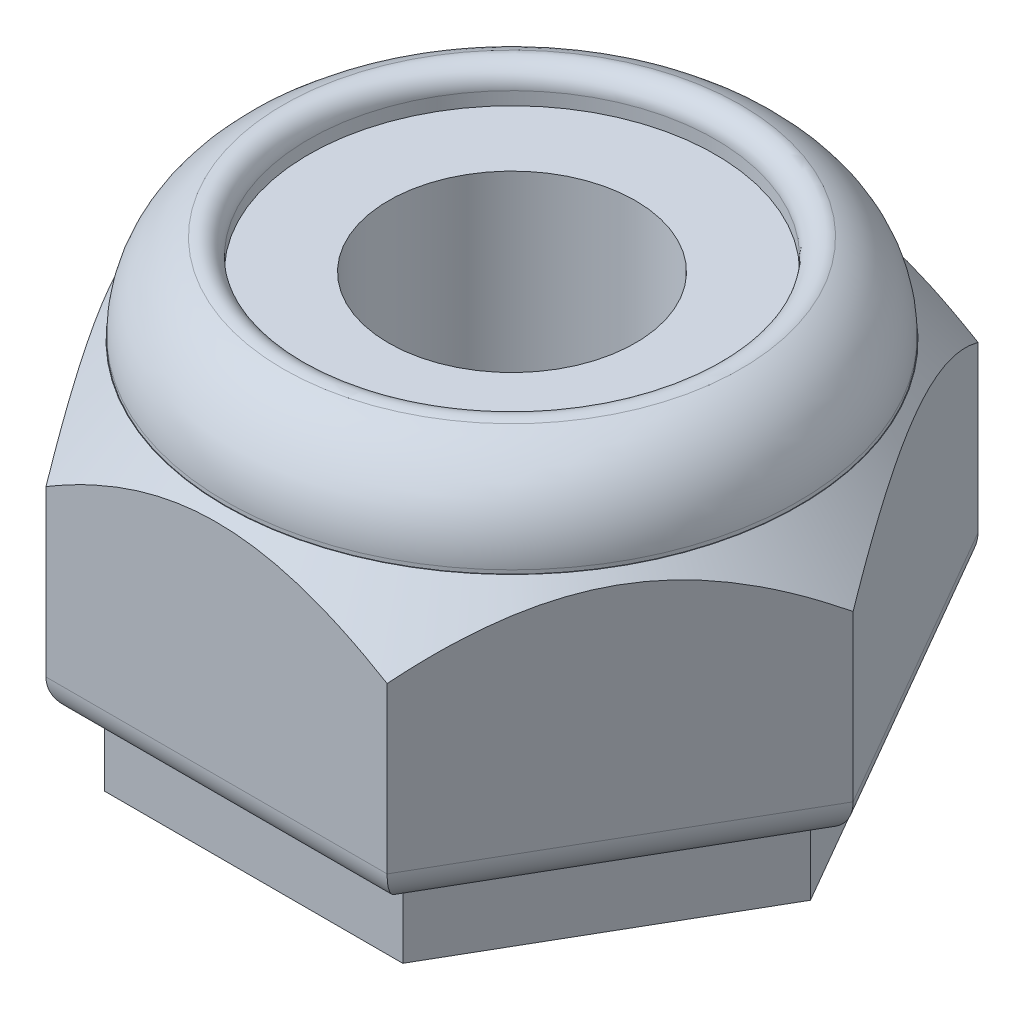
ISO-10303-21;
HEADER;
FILE_DESCRIPTION(('STEP AP214'),'2;1');
FILE_NAME('part.step','',(''),(''),'','','');
FILE_SCHEMA(('AUTOMOTIVE_DESIGN { 1 0 10303 214 1 1 1 1 }'));
ENDSEC;
DATA;
#1=APPLICATION_CONTEXT('core data for automotive mechanical design processes');
#2=APPLICATION_PROTOCOL_DEFINITION('international standard','automotive_design',2000,#1);
#3=PRODUCT_CONTEXT('',#1,'mechanical');
#4=PRODUCT('Part','Part','',(#3));
#5=PRODUCT_RELATED_PRODUCT_CATEGORY('part','',(#4));
#6=PRODUCT_DEFINITION_FORMATION('','',#4);
#7=PRODUCT_DEFINITION_CONTEXT('part definition',#1,'design');
#8=PRODUCT_DEFINITION('design','',#6,#7);
#9=PRODUCT_DEFINITION_SHAPE('','',#8);
#10=(LENGTH_UNIT() NAMED_UNIT(*) SI_UNIT(.MILLI.,.METRE.));
#11=(NAMED_UNIT(*) PLANE_ANGLE_UNIT() SI_UNIT($,.RADIAN.));
#12=(NAMED_UNIT(*) SI_UNIT($,.STERADIAN.) SOLID_ANGLE_UNIT());
#13=UNCERTAINTY_MEASURE_WITH_UNIT(LENGTH_MEASURE(1.E-05),#10,'distance_accuracy_value','');
#14=(GEOMETRIC_REPRESENTATION_CONTEXT(3) GLOBAL_UNCERTAINTY_ASSIGNED_CONTEXT((#13)) GLOBAL_UNIT_ASSIGNED_CONTEXT((#10,
#11,#12)) REPRESENTATION_CONTEXT('',''));
#15=CARTESIAN_POINT('',(0.,0.,0.));
#16=DIRECTION('',(0.,0.,1.));
#17=DIRECTION('',(1.,0.,0.));
#18=AXIS2_PLACEMENT_3D('',#15,#16,#17);
#19=CARTESIAN_POINT('',(0.,4.9784,0.));
#20=DIRECTION('',(0.,-1.,0.));
#21=DIRECTION('',(0.,0.,-1.));
#22=AXIS2_PLACEMENT_3D('',#19,#20,#21);
#23=CYLINDRICAL_SURFACE('',#22,3.937);
#24=CARTESIAN_POINT('',(0.,3.7084,0.));
#25=DIRECTION('',(0.,1.,0.));
#26=DIRECTION('',(-1.,0.,0.));
#27=AXIS2_PLACEMENT_3D('',#24,#25,#26);
#28=CIRCLE('',#27,3.937);
#29=CARTESIAN_POINT('',(-3.937,3.7084,0.));
#30=VERTEX_POINT('',#29);
#31=EDGE_CURVE('E143',#30,#30,#28,.T.);
#32=ORIENTED_EDGE('',*,*,#31,.F.);
#33=EDGE_LOOP('',(#32));
#34=FACE_BOUND('',#33,.T.);
#35=CARTESIAN_POINT('',(0.,3.6576,0.));
#36=DIRECTION('',(0.,-1.,0.));
#37=DIRECTION('',(0.,0.,-1.));
#38=AXIS2_PLACEMENT_3D('',#35,#36,#37);
#39=CIRCLE('',#38,3.937);
#40=CARTESIAN_POINT('',(0.,3.6576,-3.937));
#41=VERTEX_POINT('',#40);
#42=EDGE_CURVE('E21',#41,#41,#39,.F.);
#43=ORIENTED_EDGE('',*,*,#42,.T.);
#44=EDGE_LOOP('',(#43));
#45=FACE_BOUND('',#44,.T.);
#46=ADVANCED_FACE('F17',(#34,#45),#23,.T.);
#47=CARTESIAN_POINT('',(0.,3.7084,0.));
#48=DIRECTION('',(0.,-1.,0.));
#49=DIRECTION('',(1.,0.,0.));
#50=AXIS2_PLACEMENT_3D('',#47,#48,#49);
#51=TOROIDAL_SURFACE('',#50,2.667,1.27);
#52=ORIENTED_EDGE('',*,*,#31,.T.);
#53=EDGE_LOOP('',(#52));
#54=FACE_BOUND('',#53,.T.);
#55=CARTESIAN_POINT('',(0.,4.88572150982674,0.));
#56=DIRECTION('',(0.,1.,0.));
#57=DIRECTION('',(0.,0.,1.));
#58=AXIS2_PLACEMENT_3D('',#55,#56,#57);
#59=CIRCLE('',#58,3.14325000000061);
#60=CARTESIAN_POINT('',(0.,4.88572150982674,3.14325000000061));
#61=VERTEX_POINT('',#60);
#62=EDGE_CURVE('E140',#61,#61,#59,.T.);
#63=ORIENTED_EDGE('',*,*,#62,.F.);
#64=EDGE_LOOP('',(#63));
#65=FACE_BOUND('',#64,.T.);
#66=ADVANCED_FACE('F326',(#54,#65),#51,.T.);
#67=CARTESIAN_POINT('',(2.34315,3.6576,4.05845484975428));
#68=DIRECTION('',(0.,-1.,0.));
#69=DIRECTION('',(0.,0.,-1.));
#70=AXIS2_PLACEMENT_3D('',#67,#68,#69);
#71=PLANE('',#70);
#72=CARTESIAN_POINT('',(0.,3.65760000005366,0.));
#73=DIRECTION('',(0.,-1.,0.));
#74=DIRECTION('',(0.,0.,-1.));
#75=AXIS2_PLACEMENT_3D('',#72,#73,#74);
#76=CIRCLE('',#75,3.94407100941407);
#77=CARTESIAN_POINT('',(0.,3.65760000005366,-3.94407100941407));
#78=VERTEX_POINT('',#77);
#79=EDGE_CURVE('E139',#78,#78,#76,.T.);
#80=ORIENTED_EDGE('',*,*,#79,.F.);
#81=EDGE_LOOP('',(#80));
#82=FACE_BOUND('',#81,.T.);
#83=ORIENTED_EDGE('',*,*,#42,.F.);
#84=EDGE_LOOP('',(#83));
#85=FACE_BOUND('',#84,.T.);
#86=ADVANCED_FACE('F201',(#82,#85),#71,.F.);
#87=CARTESIAN_POINT('',(0.,4.6502572078617,0.));
#88=DIRECTION('',(0.,-1.,0.));
#89=DIRECTION('',(0.,0.,-1.));
#90=AXIS2_PLACEMENT_3D('',#87,#88,#89);
#91=TOROIDAL_SURFACE('',#90,3.048,0.254);
#92=CARTESIAN_POINT('',(0.,4.6502572078617,0.));
#93=DIRECTION('',(0.,1.,0.));
#94=DIRECTION('',(0.,0.,1.));
#95=AXIS2_PLACEMENT_3D('',#92,#93,#94);
#96=CIRCLE('',#95,2.794);
#97=CARTESIAN_POINT('',(0.,4.6502572078617,2.794));
#98=VERTEX_POINT('',#97);
#99=EDGE_CURVE('E116',#98,#98,#96,.F.);
#100=ORIENTED_EDGE('',*,*,#99,.T.);
#101=EDGE_LOOP('',(#100));
#102=FACE_BOUND('',#101,.T.);
#103=ORIENTED_EDGE('',*,*,#62,.T.);
#104=EDGE_LOOP('',(#103));
#105=FACE_BOUND('',#104,.T.);
#106=ADVANCED_FACE('F19',(#102,#105),#91,.T.);
#107=CARTESIAN_POINT('',(0.,2.76773860963431,0.));
#108=DIRECTION('',(0.,-1.,0.));
#109=DIRECTION('',(0.,0.,-1.));
#110=AXIS2_PLACEMENT_3D('',#107,#108,#109);
#111=CONICAL_SURFACE('',#110,4.69075337394997,0.69813170082155);
#112=CARTESIAN_POINT('',(-2.34315000000503,2.77304593403586,4.05845484975428));
#113=CARTESIAN_POINT('',(-2.27415972165278,2.81414935275577,4.05845484975428));
#114=CARTESIAN_POINT('',(-2.20457738516752,2.85425669888616,4.05845484975428));
#115=CARTESIAN_POINT('',(-2.06410193522583,2.93218331971622,4.05845484975428));
#116=CARTESIAN_POINT('',(-1.99320821635581,2.97000150134695,4.05845484975428));
#117=CARTESIAN_POINT('',(-1.77754688766656,3.07999086389214,4.05845484975428));
#118=CARTESIAN_POINT('',(-1.63068545864015,3.14815894039376,4.05845484975428));
#119=CARTESIAN_POINT('',(-1.33052752451739,3.27077676920759,4.05845484975428));
#120=CARTESIAN_POINT('',(-1.17720631603001,3.32516696805276,4.05845484975428));
#121=CARTESIAN_POINT('',(-0.865613503742559,3.41574608766322,4.05845484975428));
#122=CARTESIAN_POINT('',(-0.707359229246045,3.45199244874761,4.05845484975428));
#123=CARTESIAN_POINT('',(-0.456822143289617,3.49192146545915,4.05845484975428));
#124=CARTESIAN_POINT('',(-0.3656729211117,3.50290887294284,4.05845484975428));
#125=CARTESIAN_POINT('',(-0.183016321982117,3.51758027912042,4.05845484975428));
#126=CARTESIAN_POINT('',(-0.0915105175139001,3.52128341035451,4.05845484975428));
#127=CARTESIAN_POINT('',(0.104649468640172,3.52128177490176,4.05845484975428));
#128=CARTESIAN_POINT('',(0.209305100869491,3.51643705331943,4.05845484975428));
#129=CARTESIAN_POINT('',(0.417787181905034,3.49730239558541,4.05845484975428));
#130=CARTESIAN_POINT('',(0.521613181347001,3.48300765110126,4.05845484975428));
#131=CARTESIAN_POINT('',(0.728332544905683,3.44553375884967,4.05845484975428));
#132=CARTESIAN_POINT('',(0.831215331549728,3.42229697723049,4.05845484975428));
#133=CARTESIAN_POINT('',(1.03487580390072,3.36791830053848,4.05845484975428));
#134=CARTESIAN_POINT('',(1.13565289467684,3.3367742032106,4.05845484975428));
#135=CARTESIAN_POINT('',(1.33273383820583,3.2683874191788,4.05845484975428));
#136=CARTESIAN_POINT('',(1.4290871622408,3.23128582684769,4.05845484975428));
#137=CARTESIAN_POINT('',(1.61947291705641,3.15151071592813,4.05845484975428));
#138=CARTESIAN_POINT('',(1.71350470706801,3.10883567900622,4.05845484975428));
#139=CARTESIAN_POINT('',(1.89803195378754,3.01941532333673,4.05845484975428));
#140=CARTESIAN_POINT('',(1.98855798042494,2.97273255728481,4.05845484975428));
#141=CARTESIAN_POINT('',(2.16742834953656,2.87556944087748,4.05845484975428));
#142=CARTESIAN_POINT('',(2.25577492887676,2.82509321935989,4.05845484975428));
#143=CARTESIAN_POINT('',(2.34315000000525,2.77304593403573,4.05845484975428));
#144=B_SPLINE_CURVE_WITH_KNOTS('',3,(#112,#113,#114,#115,#116,#117,#118,#119,#120,#121,#122,
#123,#124,#125,#126,#127,#128,#129,#130,#131,#132,#133,#134,#135,#136,#137,#138,#139,#140,#141,
#142,#143),.UNSPECIFIED.,.F.,.F.,(4,2,2,2,2,2,2,2,2,2,2,2,2,2,2,4),(0.,0.240903303558803,
0.481920744734919,0.967059466966206,1.45426068374679,1.9399095917674,2.21507934692009,
2.48952538382291,2.80337599588965,3.11738642352583,3.43345557964228,3.74961286046901,
4.05916118097216,4.3687940060889,4.6742570853317,4.97939238053971),.UNSPECIFIED.);
#145=CARTESIAN_POINT('',(-2.34315000000099,2.77304593403526,4.05845484975719));
#146=VERTEX_POINT('',#145);
#147=CARTESIAN_POINT('',(2.34315000000292,2.77304593403765,4.05845484975376));
#148=VERTEX_POINT('',#147);
#149=EDGE_CURVE('E105',#146,#148,#144,.T.);
#150=ORIENTED_EDGE('',*,*,#149,.T.);
#151=CARTESIAN_POINT('',(2.34314999999693,2.7730459340352,4.05845484975959));
#152=CARTESIAN_POINT('',(2.37767282860283,2.81418235893276,3.99865955659319));
#153=CARTESIAN_POINT('',(2.41249219713531,2.85432113114593,3.93835064120748));
#154=CARTESIAN_POINT('',(2.48278735561404,2.93230661024316,3.81659585519621));
#155=CARTESIAN_POINT('',(2.51826344808292,2.97015222465259,3.7551494605861));
#156=CARTESIAN_POINT('',(2.62615438117551,3.08018701502904,3.56827688279372));
#157=CARTESIAN_POINT('',(2.69961665998572,3.14837015578544,3.44103648345466));
#158=CARTESIAN_POINT('',(2.84967035005879,3.27092778611003,3.18113586838493));
#159=CARTESIAN_POINT('',(2.92627056070785,3.32525984887746,3.04846041167028));
#160=CARTESIAN_POINT('',(3.08197408351963,3.41577217646363,2.77877399924282));
#161=CARTESIAN_POINT('',(3.16107001759542,3.45200143013163,2.64177582275144));
#162=CARTESIAN_POINT('',(3.29198414807309,3.49372811242707,2.41502589733543));
#163=CARTESIAN_POINT('',(3.34330313984229,3.50560413714313,2.32613879619797));
#164=CARTESIAN_POINT('',(3.44628593295617,3.52008140701373,2.14776736621938));
#165=CARTESIAN_POINT('',(3.49794979170342,3.52268106751377,2.05828293795409));
#166=CARTESIAN_POINT('',(3.60089965453731,3.51847006522478,1.87996854489356));
#167=CARTESIAN_POINT('',(3.65218619119779,3.51171021115691,1.79113765765336));
#168=CARTESIAN_POINT('',(3.75425802296563,3.48921023552174,1.61434405900985));
#169=CARTESIAN_POINT('',(3.80504329290657,3.4734696653816,1.52638139119605));
#170=CARTESIAN_POINT('',(3.91981939871964,3.42817062217697,1.32758334443292));
#171=CARTESIAN_POINT('',(3.98355100429821,3.39598542071065,1.2171969655229));
#172=CARTESIAN_POINT('',(4.10926833268307,3.32004827839878,0.999448165368507));
#173=CARTESIAN_POINT('',(4.17125308046242,3.27629001407983,0.892087432920332));
#174=CARTESIAN_POINT('',(4.29356093179487,3.17910361378463,0.680244020247964));
#175=CARTESIAN_POINT('',(4.35387635271594,3.12563730722699,0.575774646732767));
#176=CARTESIAN_POINT('',(4.47261995690137,3.01104764598552,0.370104691209757));
#177=CARTESIAN_POINT('',(4.53104876921398,2.94992687737875,0.268903019658414));
#178=CARTESIAN_POINT('',(4.60505373916612,2.86741854615462,0.140722651688709));
#179=CARTESIAN_POINT('',(4.62142679900212,2.84883596641678,0.11236368017739));
#180=CARTESIAN_POINT('',(4.65398784239057,2.81125673905797,0.0559662986811411));
#181=CARTESIAN_POINT('',(4.67017623558143,2.79226151162781,0.0279271791816869));
#182=CARTESIAN_POINT('',(4.68630000000264,2.77304593403495,-5.12766597102743E-12));
#183=B_SPLINE_CURVE_WITH_KNOTS('',3,(#151,#152,#153,#154,#155,#156,#157,#158,#159,#160,#161,
#162,#163,#164,#165,#166,#167,#168,#169,#170,#171,#172,#173,#174,#175,#176,#177,#178,#179,#180,
#181,#182),.UNSPECIFIED.,.F.,.F.,(4,2,2,2,2,2,2,2,2,2,2,2,2,2,2,4),(0.,0.241096809088417,
0.482307589452315,0.967637153847078,1.45443592242607,1.93991010956602,2.24950193434581,
2.55914664327121,2.86711700075051,3.17510274221903,3.56882084719782,3.96275452415155,
4.35827201945911,4.75365624697757,4.8666083898492,4.97921936890997),.UNSPECIFIED.);
#184=CARTESIAN_POINT('',(4.68630000000163,2.77304593403615,-2.0235874094859E-12));
#185=VERTEX_POINT('',#184);
#186=EDGE_CURVE('E179',#148,#185,#183,.T.);
#187=ORIENTED_EDGE('',*,*,#186,.T.);
#188=CARTESIAN_POINT('',(4.68630000000062,2.77304593403735,1.0800383224823E-12));
#189=CARTESIAN_POINT('',(4.65177717139479,2.81418235893479,-0.0597952931652156));
#190=CARTESIAN_POINT('',(4.61695780286237,2.85432113114784,-0.120104208550831));
#191=CARTESIAN_POINT('',(4.54666264438375,2.93230661024482,-0.241858994561891));
#192=CARTESIAN_POINT('',(4.51118655191493,2.97015222465413,-0.303305389171897));
#193=CARTESIAN_POINT('',(4.40329561882253,3.08018701503022,-0.49017796696395));
#194=CARTESIAN_POINT('',(4.32983334001245,3.1483701557864,-0.617418366302786));
#195=CARTESIAN_POINT('',(4.17977964993967,3.27092778611056,-0.877318981372035));
#196=CARTESIAN_POINT('',(4.10317943929075,3.32525984887779,-1.00999443808643));
#197=CARTESIAN_POINT('',(3.94747591647927,3.41577217646364,-1.27968085051336));
#198=CARTESIAN_POINT('',(3.86837998240365,3.45200143013151,-1.41667902700445));
#199=CARTESIAN_POINT('',(3.73746585192614,3.49372811242684,-1.64342895242018));
#200=CARTESIAN_POINT('',(3.68614686015695,3.50560413714288,-1.73231605355763));
#201=CARTESIAN_POINT('',(3.58316406704307,3.52008140701343,-1.91068748353621));
#202=CARTESIAN_POINT('',(3.53150020829583,3.52268106751345,-2.00017191180149));
#203=CARTESIAN_POINT('',(3.42855034546195,3.51847006522442,-2.17848630486201));
#204=CARTESIAN_POINT('',(3.37726380880147,3.51171021115652,-2.2673171921022));
#205=CARTESIAN_POINT('',(3.27519197703364,3.48921023552132,-2.44411079074569));
#206=CARTESIAN_POINT('',(3.2244067070927,3.47346966538116,-2.53207345855949));
#207=CARTESIAN_POINT('',(3.10963060127963,3.42817062217649,-2.73087150532264));
#208=CARTESIAN_POINT('',(3.04589899570104,3.39598542071013,-2.84125788423269));
#209=CARTESIAN_POINT('',(2.92018166731615,3.32004827839821,-3.05900668438713));
#210=CARTESIAN_POINT('',(2.85819691953678,3.27629001407922,-3.16636741683533));
#211=CARTESIAN_POINT('',(2.73588906820431,3.17910361378396,-3.37821082950774));
#212=CARTESIAN_POINT('',(2.67557364728322,3.12563730722629,-3.48268020302296));
#213=CARTESIAN_POINT('',(2.55683004309777,3.01104764598475,-3.68835015854601));
#214=CARTESIAN_POINT('',(2.49840123078514,2.94992687737795,-3.78955183009737));
#215=CARTESIAN_POINT('',(2.42439626083308,2.86741854615387,-3.91773219806696));
#216=CARTESIAN_POINT('',(2.40802320099716,2.84883596641612,-3.94609116957814));
#217=CARTESIAN_POINT('',(2.37546215760886,2.81125673905749,-4.00248855107411));
#218=CARTESIAN_POINT('',(2.35927376441809,2.79226151162742,-4.03052767057343));
#219=CARTESIAN_POINT('',(2.34314999999696,2.77304593403466,-4.0584548497601));
#220=B_SPLINE_CURVE_WITH_KNOTS('',3,(#188,#189,#190,#191,#192,#193,#194,#195,#196,#197,#198,
#199,#200,#201,#202,#203,#204,#205,#206,#207,#208,#209,#210,#211,#212,#213,#214,#215,#216,#217,
#218,#219),.UNSPECIFIED.,.F.,.F.,(4,2,2,2,2,2,2,2,2,2,2,2,2,2,2,4),(0.,0.241096809087928,
0.482307589451335,0.967637153845095,1.45443592242307,1.939910109562,2.24950193434176,
2.55914664326713,2.86711700074641,3.17510274221491,3.56882084719382,3.96275452414766,
4.35827201945532,4.7536562469739,4.86660838984497,4.97921936890519),.UNSPECIFIED.);
#221=CARTESIAN_POINT('',(2.34315000000099,2.77304593403526,-4.05845484975719));
#222=VERTEX_POINT('',#221);
#223=EDGE_CURVE('E186',#185,#222,#220,.T.);
#224=ORIENTED_EDGE('',*,*,#223,.T.);
#225=CARTESIAN_POINT('',(2.34315000000503,2.77304593403586,-4.05845484975428));
#226=CARTESIAN_POINT('',(2.27415972165278,2.81414935275577,-4.05845484975428));
#227=CARTESIAN_POINT('',(2.20457738516752,2.85425669888616,-4.05845484975428));
#228=CARTESIAN_POINT('',(2.06410193522583,2.93218331971622,-4.05845484975428));
#229=CARTESIAN_POINT('',(1.99320821635581,2.97000150134695,-4.05845484975428));
#230=CARTESIAN_POINT('',(1.77754688766656,3.07999086389214,-4.05845484975428));
#231=CARTESIAN_POINT('',(1.63068545864015,3.14815894039376,-4.05845484975428));
#232=CARTESIAN_POINT('',(1.33052752451739,3.27077676920759,-4.05845484975428));
#233=CARTESIAN_POINT('',(1.17720631603001,3.32516696805276,-4.05845484975428));
#234=CARTESIAN_POINT('',(0.865613503742559,3.41574608766322,-4.05845484975428));
#235=CARTESIAN_POINT('',(0.707359229246045,3.45199244874761,-4.05845484975428));
#236=CARTESIAN_POINT('',(0.456822143289617,3.49192146545915,-4.05845484975428));
#237=CARTESIAN_POINT('',(0.3656729211117,3.50290887294284,-4.05845484975428));
#238=CARTESIAN_POINT('',(0.183016321982117,3.51758027912042,-4.05845484975428));
#239=CARTESIAN_POINT('',(0.0915105175139003,3.52128341035451,-4.05845484975428));
#240=CARTESIAN_POINT('',(-0.104649468640172,3.52128177490176,-4.05845484975428));
#241=CARTESIAN_POINT('',(-0.20930510086949,3.51643705331943,-4.05845484975428));
#242=CARTESIAN_POINT('',(-0.417787181905032,3.49730239558541,-4.05845484975428));
#243=CARTESIAN_POINT('',(-0.521613181346999,3.48300765110126,-4.05845484975428));
#244=CARTESIAN_POINT('',(-0.728332544905681,3.44553375884966,-4.05845484975428));
#245=CARTESIAN_POINT('',(-0.831215331549726,3.42229697723049,-4.05845484975428));
#246=CARTESIAN_POINT('',(-1.03487580390072,3.36791830053848,-4.05845484975428));
#247=CARTESIAN_POINT('',(-1.13565289467684,3.3367742032106,-4.05845484975428));
#248=CARTESIAN_POINT('',(-1.33273383820593,3.26838741917876,-4.05845484975428));
#249=CARTESIAN_POINT('',(-1.42908716224099,3.23128582684762,-4.05845484975428));
#250=CARTESIAN_POINT('',(-1.61947291705679,3.15151071592796,-4.05845484975428));
#251=CARTESIAN_POINT('',(-1.71350470706848,3.108835679006,-4.05845484975428));
#252=CARTESIAN_POINT('',(-1.89803195378819,3.01941532333641,-4.05845484975428));
#253=CARTESIAN_POINT('',(-1.98855798042567,2.97273255728443,-4.05845484975428));
#254=CARTESIAN_POINT('',(-2.16742834953745,2.87556944087698,-4.05845484975428));
#255=CARTESIAN_POINT('',(-2.25577492887773,2.82509321935933,-4.05845484975428));
#256=CARTESIAN_POINT('',(-2.3431500000063,2.7730459340351,-4.05845484975428));
#257=B_SPLINE_CURVE_WITH_KNOTS('',3,(#225,#226,#227,#228,#229,#230,#231,#232,#233,#234,#235,
#236,#237,#238,#239,#240,#241,#242,#243,#244,#245,#246,#247,#248,#249,#250,#251,#252,#253,#254,
#255,#256),.UNSPECIFIED.,.F.,.F.,(4,2,2,2,2,2,2,2,2,2,2,2,2,2,2,4),(0.,0.240903303558803,
0.481920744734919,0.967059466966205,1.45426068374679,1.93990959176741,2.21507934692009,
2.48952538382291,2.80337599588965,3.11738642352583,3.43345557964228,3.74961286046901,
4.05916118097247,4.36879400608952,4.67425708533262,4.97939238054094),.UNSPECIFIED.);
#258=CARTESIAN_POINT('',(-2.34315000000187,2.77304593403546,-4.05845484975649));
#259=VERTEX_POINT('',#258);
#260=EDGE_CURVE('E205',#222,#259,#257,.T.);
#261=ORIENTED_EDGE('',*,*,#260,.T.);
#262=CARTESIAN_POINT('',(-2.34314999999745,2.77304593403582,-4.0584548497587));
#263=CARTESIAN_POINT('',(-2.37767282860333,2.81418235893334,-3.99865955659233));
#264=CARTESIAN_POINT('',(-2.41249219713579,2.85432113114648,-3.93835064120664));
#265=CARTESIAN_POINT('',(-2.48278735561449,2.93230661024365,-3.81659585519542));
#266=CARTESIAN_POINT('',(-2.51826344808336,2.97015222465305,-3.75514946058534));
#267=CARTESIAN_POINT('',(-2.62615438117591,3.08018701502941,-3.56827688279304));
#268=CARTESIAN_POINT('',(-2.69961665998608,3.14837015578576,-3.44103648345404));
#269=CARTESIAN_POINT('',(-2.84967035005908,3.27092778611024,-3.18113586838442));
#270=CARTESIAN_POINT('',(-2.9262705607081,3.32525984887762,-3.04846041166984));
#271=CARTESIAN_POINT('',(-3.08197408351981,3.41577217646372,-2.77877399924251));
#272=CARTESIAN_POINT('',(-3.16107001759556,3.45200143013168,-2.64177582275121));
#273=CARTESIAN_POINT('',(-3.29198414807318,3.4937281124271,-2.41502589733527));
#274=CARTESIAN_POINT('',(-3.34330313984238,3.50560413714315,-2.32613879619781));
#275=CARTESIAN_POINT('',(-3.44628593295626,3.52008140701374,-2.14776736621922));
#276=CARTESIAN_POINT('',(-3.49794979170351,3.52268106751377,-2.05828293795394));
#277=CARTESIAN_POINT('',(-3.60089965453739,3.51847006522477,-1.87996854489341));
#278=CARTESIAN_POINT('',(-3.65218619119787,3.51171021115689,-1.79113765765322));
#279=CARTESIAN_POINT('',(-3.7542580229657,3.48921023552172,-1.61434405900972));
#280=CARTESIAN_POINT('',(-3.80504329290664,3.47346966538157,-1.52638139119591));
#281=CARTESIAN_POINT('',(-3.91981939871971,3.42817062217693,-1.32758334443279));
#282=CARTESIAN_POINT('',(-3.98355100429829,3.3959854207106,-1.21719696552276));
#283=CARTESIAN_POINT('',(-4.10926833268315,3.32004827839873,-0.999448165368363));
#284=CARTESIAN_POINT('',(-4.17125308046251,3.27629001407977,-0.892087432920184));
#285=CARTESIAN_POINT('',(-4.29356093179496,3.17910361378455,-0.680244020247808));
#286=CARTESIAN_POINT('',(-4.35387635271603,3.12563730722691,-0.575774646732607));
#287=CARTESIAN_POINT('',(-4.47261995690147,3.01104764598542,-0.370104691209589));
#288=CARTESIAN_POINT('',(-4.53104876921408,2.94992687737864,-0.268903019658241));
#289=CARTESIAN_POINT('',(-4.60505373916631,2.86741854615441,-0.140722651688385));
#290=CARTESIAN_POINT('',(-4.6214267990024,2.84883596641647,-0.112363680176918));
#291=CARTESIAN_POINT('',(-4.65398784239102,2.81125673905746,-0.0559662986803773));
#292=CARTESIAN_POINT('',(-4.67017623558195,2.79226151162719,-0.027927179180779));
#293=CARTESIAN_POINT('',(-4.68630000000325,2.77304593403423,6.17903219713263E-12));
#294=B_SPLINE_CURVE_WITH_KNOTS('',3,(#262,#263,#264,#265,#266,#267,#268,#269,#270,#271,#272,
#273,#274,#275,#276,#277,#278,#279,#280,#281,#282,#283,#284,#285,#286,#287,#288,#289,#290,#291,
#292,#293),.UNSPECIFIED.,.F.,.F.,(4,2,2,2,2,2,2,2,2,2,2,2,2,2,2,4),(0.,0.241096809088295,
0.48230758945207,0.967637153846581,1.45443592242532,1.93991010956502,2.24950193434479,
2.55914664327018,2.86711700074947,3.17510274221798,3.56882084719679,3.96275452415054,
4.35827201945812,4.75365624697661,4.86660838984883,4.97921936891019),.UNSPECIFIED.);
#295=CARTESIAN_POINT('',(-4.68630000000131,2.77304593403654,3.63315267297267E-12));
#296=VERTEX_POINT('',#295);
#297=EDGE_CURVE('E123',#259,#296,#294,.T.);
#298=ORIENTED_EDGE('',*,*,#297,.T.);
#299=CARTESIAN_POINT('',(-4.68629999999937,2.77304593403885,1.0880210447379E-12));
#300=CARTESIAN_POINT('',(-4.65177717139357,2.8141823589362,0.0597952931673228));
#301=CARTESIAN_POINT('',(-4.61695780286119,2.85432113114918,0.120104208552876));
#302=CARTESIAN_POINT('',(-4.54666264438265,2.93230661024601,0.24185899456381));
#303=CARTESIAN_POINT('',(-4.51118655191386,2.97015222465525,0.303305389173751));
#304=CARTESIAN_POINT('',(-4.40329561882157,3.08018701503113,0.490177966965604));
#305=CARTESIAN_POINT('',(-4.32983334001158,3.14837015578717,0.617418366304302));
#306=CARTESIAN_POINT('',(-4.17977964993896,3.27092778611108,0.877318981373256));
#307=CARTESIAN_POINT('',(-4.10317943929013,3.3252598488782,1.0099944380875));
#308=CARTESIAN_POINT('',(-3.94747591647884,3.41577217646385,1.2796808505141));
#309=CARTESIAN_POINT('',(-3.86837998240331,3.45200143013163,1.41667902700503));
#310=CARTESIAN_POINT('',(-3.73746585192592,3.4937281124269,1.64342895242057));
#311=CARTESIAN_POINT('',(-3.68614686015672,3.50560413714292,1.73231605355802));
#312=CARTESIAN_POINT('',(-3.58316406704285,3.52008140701344,1.91068748353659));
#313=CARTESIAN_POINT('',(-3.53150020829562,3.52268106751345,2.00017191180186));
#314=CARTESIAN_POINT('',(-3.42855034546175,3.51847006522439,2.17848630486236));
#315=CARTESIAN_POINT('',(-3.37726380880127,3.51171021115649,2.26731719210255));
#316=CARTESIAN_POINT('',(-3.27519197703346,3.48921023552127,2.44411079074602));
#317=CARTESIAN_POINT('',(-3.22440670709252,3.4734696653811,2.53207345855981));
#318=CARTESIAN_POINT('',(-3.10963060127944,3.4281706221764,2.73087150532296));
#319=CARTESIAN_POINT('',(-3.04589899570085,3.39598542071003,2.84125788423302));
#320=CARTESIAN_POINT('',(-2.92018166731594,3.32004827839807,3.05900668438748));
#321=CARTESIAN_POINT('',(-2.85819691953657,3.27629001407907,3.16636741683569));
#322=CARTESIAN_POINT('',(-2.73588906820409,3.17910361378377,3.37821082950812));
#323=CARTESIAN_POINT('',(-2.675573647283,3.12563730722608,3.48268020302335));
#324=CARTESIAN_POINT('',(-2.55683004309753,3.01104764598451,3.68835015854642));
#325=CARTESIAN_POINT('',(-2.4984012307849,2.94992687737769,3.78955183009779));
#326=CARTESIAN_POINT('',(-2.42439626083287,2.86741854615364,3.91773219806731));
#327=CARTESIAN_POINT('',(-2.40802320099699,2.84883596641594,3.94609116957842));
#328=CARTESIAN_POINT('',(-2.37546215760878,2.8112567390574,4.00248855107425));
#329=CARTESIAN_POINT('',(-2.35927376441805,2.79226151162737,4.0305276705735));
#330=CARTESIAN_POINT('',(-2.34314999999696,2.77304593403466,4.0584548497601));
#331=B_SPLINE_CURVE_WITH_KNOTS('',3,(#299,#300,#301,#302,#303,#304,#305,#306,#307,#308,#309,
#310,#311,#312,#313,#314,#315,#316,#317,#318,#319,#320,#321,#322,#323,#324,#325,#326,#327,#328,
#329,#330),.UNSPECIFIED.,.F.,.F.,(4,2,2,2,2,2,2,2,2,2,2,2,2,2,2,4),(0.,0.24109680908763,
0.48230758945074,0.96763715384389,1.45443592242124,1.93991010955956,2.24950193433929,
2.55914664326463,2.86711700074389,3.17510274221236,3.56882084719132,3.96275452414521,
4.35827201945292,4.75365624697154,4.86660838984234,4.97921936890228),.UNSPECIFIED.);
#332=EDGE_CURVE('E119',#296,#146,#331,.T.);
#333=ORIENTED_EDGE('',*,*,#332,.T.);
#334=EDGE_LOOP('',(#150,#187,#224,#261,#298,#333));
#335=FACE_BOUND('',#334,.T.);
#336=ORIENTED_EDGE('',*,*,#79,.T.);
#337=EDGE_LOOP('',(#336));
#338=FACE_BOUND('',#337,.T.);
#339=ADVANCED_FACE('F120',(#335,#338),#111,.T.);
#340=CARTESIAN_POINT('',(0.,4.4704,0.));
#341=DIRECTION('',(0.,1.,0.));
#342=DIRECTION('',(0.,0.,1.));
#343=AXIS2_PLACEMENT_3D('',#340,#341,#342);
#344=CYLINDRICAL_SURFACE('',#343,2.794);
#345=ORIENTED_EDGE('',*,*,#99,.F.);
#346=EDGE_LOOP('',(#345));
#347=FACE_BOUND('',#346,.T.);
#348=CARTESIAN_POINT('',(0.,4.4704,0.));
#349=DIRECTION('',(0.,1.,0.));
#350=DIRECTION('',(0.,0.,1.));
#351=AXIS2_PLACEMENT_3D('',#348,#349,#350);
#352=CIRCLE('',#351,2.794);
#353=CARTESIAN_POINT('',(0.,4.4704,2.794));
#354=VERTEX_POINT('',#353);
#355=EDGE_CURVE('E176',#354,#354,#352,.T.);
#356=ORIENTED_EDGE('',*,*,#355,.F.);
#357=EDGE_LOOP('',(#356));
#358=FACE_BOUND('',#357,.T.);
#359=ADVANCED_FACE('F199',(#347,#358),#344,.F.);
#360=CARTESIAN_POINT('',(-2.34315,3.6576,4.05845484975428));
#361=DIRECTION('',(0.,0.,-1.));
#362=DIRECTION('',(-1.,0.,0.));
#363=AXIS2_PLACEMENT_3D('',#360,#361,#362);
#364=PLANE('',#363);
#365=DIRECTION('',(0.,1.,0.));
#366=VECTOR('',#365,1.);
#367=CARTESIAN_POINT('',(-2.34314999999753,3.6576,4.0584548497591));
#368=LINE('',#367,#366);
#369=CARTESIAN_POINT('',(-2.34314999999873,0.508,4.05845484975666));
#370=VERTEX_POINT('',#369);
#371=EDGE_CURVE('E109',#146,#370,#368,.F.);
#372=ORIENTED_EDGE('',*,*,#371,.T.);
#373=DIRECTION('',(-1.,0.,0.));
#374=VECTOR('',#373,1.);
#375=CARTESIAN_POINT('',(-2.34315,0.508,4.05845484975428));
#376=LINE('',#375,#374);
#377=CARTESIAN_POINT('',(2.34315000000028,0.508,4.05845484975376));
#378=VERTEX_POINT('',#377);
#379=EDGE_CURVE('E175',#378,#370,#376,.T.);
#380=ORIENTED_EDGE('',*,*,#379,.F.);
#381=DIRECTION('',(0.,1.,0.));
#382=VECTOR('',#381,1.);
#383=CARTESIAN_POINT('',(2.3431500000006,3.6576,4.05845484975324));
#384=LINE('',#383,#382);
#385=EDGE_CURVE('E112',#378,#148,#384,.T.);
#386=ORIENTED_EDGE('',*,*,#385,.T.);
#387=ORIENTED_EDGE('',*,*,#149,.F.);
#388=EDGE_LOOP('',(#372,#380,#386,#387));
#389=FACE_BOUND('',#388,.T.);
#390=ADVANCED_FACE('F107',(#389),#364,.F.);
#391=CARTESIAN_POINT('',(-4.6863,3.6576,0.));
#392=DIRECTION('',(0.866025403784429,0.,-0.500000000000017));
#393=DIRECTION('',(-0.500000000000017,0.,-0.866025403784429));
#394=AXIS2_PLACEMENT_3D('',#391,#392,#393);
#395=PLANE('',#394);
#396=DIRECTION('',(0.,1.,0.));
#397=VECTOR('',#396,1.);
#398=CARTESIAN_POINT('',(-4.68630000000425,3.6576,7.90860432697826E-12));
#399=LINE('',#398,#397);
#400=CARTESIAN_POINT('',(-4.68630000000196,0.508,3.98548652847525E-12));
#401=VERTEX_POINT('',#400);
#402=EDGE_CURVE('E126',#296,#401,#399,.F.);
#403=ORIENTED_EDGE('',*,*,#402,.T.);
#404=DIRECTION('',(-0.500000000000017,0.,-0.866025403784429));
#405=VECTOR('',#404,1.);
#406=CARTESIAN_POINT('',(-4.68629999999971,0.508,0.));
#407=LINE('',#406,#405);
#408=EDGE_CURVE('E131',#370,#401,#407,.T.);
#409=ORIENTED_EDGE('',*,*,#408,.F.);
#410=ORIENTED_EDGE('',*,*,#371,.F.);
#411=ORIENTED_EDGE('',*,*,#332,.F.);
#412=EDGE_LOOP('',(#403,#409,#410,#411));
#413=FACE_BOUND('',#412,.T.);
#414=ADVANCED_FACE('F129',(#413),#395,.F.);
#415=CARTESIAN_POINT('',(-2.34315,3.6576,-4.05845484975428));
#416=DIRECTION('',(0.866025403784429,0.,0.500000000000017));
#417=DIRECTION('',(0.500000000000017,0.,-0.866025403784429));
#418=AXIS2_PLACEMENT_3D('',#415,#416,#417);
#419=PLANE('',#418);
#420=DIRECTION('',(0.,1.,0.));
#421=VECTOR('',#420,1.);
#422=CARTESIAN_POINT('',(-2.34315000000484,3.6576,-4.05845484975428));
#423=LINE('',#422,#421);
#424=CARTESIAN_POINT('',(-2.3431500000024,0.508,-4.05845484975428));
#425=VERTEX_POINT('',#424);
#426=EDGE_CURVE('E457',#259,#425,#423,.F.);
#427=ORIENTED_EDGE('',*,*,#426,.T.);
#428=DIRECTION('',(0.500000000000017,0.,-0.866025403784429));
#429=VECTOR('',#428,1.);
#430=CARTESIAN_POINT('',(-2.34314999999996,0.508,-4.05845484975429));
#431=LINE('',#430,#429);
#432=EDGE_CURVE('E169',#401,#425,#431,.T.);
#433=ORIENTED_EDGE('',*,*,#432,.F.);
#434=ORIENTED_EDGE('',*,*,#402,.F.);
#435=ORIENTED_EDGE('',*,*,#297,.F.);
#436=EDGE_LOOP('',(#427,#433,#434,#435));
#437=FACE_BOUND('',#436,.T.);
#438=ADVANCED_FACE('F229',(#437),#419,.F.);
#439=CARTESIAN_POINT('',(2.34315,3.6576,-4.05845484975428));
#440=DIRECTION('',(0.,0.,1.));
#441=DIRECTION('',(1.,0.,0.));
#442=AXIS2_PLACEMENT_3D('',#439,#440,#441);
#443=PLANE('',#442);
#444=DIRECTION('',(0.,1.,0.));
#445=VECTOR('',#444,1.);
#446=CARTESIAN_POINT('',(2.34314999999753,3.6576,-4.0584548497591));
#447=LINE('',#446,#445);
#448=CARTESIAN_POINT('',(2.34314999999873,0.508,-4.05845484975666));
#449=VERTEX_POINT('',#448);
#450=EDGE_CURVE('E456',#222,#449,#447,.F.);
#451=ORIENTED_EDGE('',*,*,#450,.T.);
#452=DIRECTION('',(1.,0.,0.));
#453=VECTOR('',#452,1.);
#454=CARTESIAN_POINT('',(2.34315,0.508,-4.05845484975428));
#455=LINE('',#454,#453);
#456=EDGE_CURVE('E168',#425,#449,#455,.T.);
#457=ORIENTED_EDGE('',*,*,#456,.F.);
#458=ORIENTED_EDGE('',*,*,#426,.F.);
#459=ORIENTED_EDGE('',*,*,#260,.F.);
#460=EDGE_LOOP('',(#451,#457,#458,#459));
#461=FACE_BOUND('',#460,.T.);
#462=ADVANCED_FACE('F232',(#461),#443,.F.);
#463=CARTESIAN_POINT('',(4.6863,3.6576,0.));
#464=DIRECTION('',(-0.866025403784429,0.,0.500000000000017));
#465=DIRECTION('',(0.500000000000017,0.,0.866025403784429));
#466=AXIS2_PLACEMENT_3D('',#463,#464,#465);
#467=PLANE('',#466);
#468=DIRECTION('',(0.,1.,0.));
#469=VECTOR('',#468,1.);
#470=CARTESIAN_POINT('',(4.68630000000282,3.6576,-5.43575601197333E-12));
#471=LINE('',#470,#469);
#472=CARTESIAN_POINT('',(4.68630000000124,0.508,-2.74906237097278E-12));
#473=VERTEX_POINT('',#472);
#474=EDGE_CURVE('E454',#185,#473,#471,.F.);
#475=ORIENTED_EDGE('',*,*,#474,.T.);
#476=DIRECTION('',(0.500000000000017,0.,0.866025403784429));
#477=VECTOR('',#476,1.);
#478=CARTESIAN_POINT('',(4.68629999999971,0.508,0.));
#479=LINE('',#478,#477);
#480=EDGE_CURVE('E164',#449,#473,#479,.T.);
#481=ORIENTED_EDGE('',*,*,#480,.F.);
#482=ORIENTED_EDGE('',*,*,#450,.F.);
#483=ORIENTED_EDGE('',*,*,#223,.F.);
#484=EDGE_LOOP('',(#475,#481,#482,#483));
#485=FACE_BOUND('',#484,.T.);
#486=ADVANCED_FACE('F236',(#485),#467,.F.);
#487=CARTESIAN_POINT('',(2.34315,3.6576,4.05845484975428));
#488=DIRECTION('',(-0.866025403784429,0.,-0.500000000000017));
#489=DIRECTION('',(-0.500000000000017,0.,0.866025403784429));
#490=AXIS2_PLACEMENT_3D('',#487,#488,#489);
#491=PLANE('',#490);
#492=ORIENTED_EDGE('',*,*,#385,.F.);
#493=DIRECTION('',(-0.500000000000017,0.,0.866025403784429));
#494=VECTOR('',#493,1.);
#495=CARTESIAN_POINT('',(2.34314999999996,0.508,4.05845484975429));
#496=LINE('',#495,#494);
#497=EDGE_CURVE('E160',#473,#378,#496,.T.);
#498=ORIENTED_EDGE('',*,*,#497,.F.);
#499=ORIENTED_EDGE('',*,*,#474,.F.);
#500=ORIENTED_EDGE('',*,*,#186,.F.);
#501=EDGE_LOOP('',(#492,#498,#499,#500));
#502=FACE_BOUND('',#501,.T.);
#503=ADVANCED_FACE('F192',(#502),#491,.F.);
#504=CARTESIAN_POINT('',(0.,4.4704,0.));
#505=DIRECTION('',(0.,1.,0.));
#506=DIRECTION('',(0.,0.,1.));
#507=AXIS2_PLACEMENT_3D('',#504,#505,#506);
#508=PLANE('',#507);
#509=ORIENTED_EDGE('',*,*,#355,.T.);
#510=EDGE_LOOP('',(#509));
#511=FACE_BOUND('',#510,.T.);
#512=CARTESIAN_POINT('',(0.,4.4704,0.));
#513=DIRECTION('',(0.,1.,0.));
#514=DIRECTION('',(0.,0.,1.));
#515=AXIS2_PLACEMENT_3D('',#512,#513,#514);
#516=CIRCLE('',#515,1.69545);
#517=CARTESIAN_POINT('',(0.,4.4704,1.69545));
#518=VERTEX_POINT('',#517);
#519=EDGE_CURVE('E150',#518,#518,#516,.F.);
#520=ORIENTED_EDGE('',*,*,#519,.T.);
#521=EDGE_LOOP('',(#520));
#522=FACE_BOUND('',#521,.T.);
#523=ADVANCED_FACE('F245',(#511,#522),#508,.T.);
#524=CARTESIAN_POINT('',(-2.34315,0.508,3.55045484975428));
#525=DIRECTION('',(-1.,0.,0.));
#526=DIRECTION('',(0.,0.,1.));
#527=AXIS2_PLACEMENT_3D('',#524,#525,#526);
#528=CYLINDRICAL_SURFACE('',#527,0.508);
#529=ORIENTED_EDGE('',*,*,#379,.T.);
#530=CARTESIAN_POINT('',(-2.04985606325171,0.508,3.55045484975428));
#531=DIRECTION('',(-0.866025403784443,0.,-0.499999999999992));
#532=DIRECTION('',(0.499999999999992,0.,-0.866025403784444));
#533=AXIS2_PLACEMENT_3D('',#530,#531,#532);
#534=ELLIPSE('',#533,0.586587873496657,0.508);
#535=CARTESIAN_POINT('',(-2.04985606325172,0.,3.55045484975428));
#536=VERTEX_POINT('',#535);
#537=EDGE_CURVE('E173',#536,#370,#534,.T.);
#538=ORIENTED_EDGE('',*,*,#537,.F.);
#539=DIRECTION('',(-1.,0.,0.));
#540=VECTOR('',#539,1.);
#541=CARTESIAN_POINT('',(2.04985606325173,0.,3.55045484975428));
#542=LINE('',#541,#540);
#543=CARTESIAN_POINT('',(2.04985606325164,0.,3.55045484975426));
#544=VERTEX_POINT('',#543);
#545=EDGE_CURVE('E153',#536,#544,#542,.F.);
#546=ORIENTED_EDGE('',*,*,#545,.T.);
#547=CARTESIAN_POINT('',(2.04985606325165,0.508,3.55045484975428));
#548=DIRECTION('',(-0.866025403784443,0.,0.499999999999992));
#549=DIRECTION('',(0.499999999999992,0.,0.866025403784444));
#550=AXIS2_PLACEMENT_3D('',#547,#548,#549);
#551=ELLIPSE('',#550,0.586587873496657,0.508);
#552=EDGE_CURVE('E157',#378,#544,#551,.F.);
#553=ORIENTED_EDGE('',*,*,#552,.F.);
#554=EDGE_LOOP('',(#529,#538,#546,#553));
#555=FACE_BOUND('',#554,.T.);
#556=ADVANCED_FACE('F302',(#555),#528,.T.);
#557=CARTESIAN_POINT('',(-4.24635909487722,0.508,-0.254));
#558=DIRECTION('',(-0.500000000000017,0.,-0.866025403784429));
#559=DIRECTION('',(-0.866025403784429,0.,0.500000000000017));
#560=AXIS2_PLACEMENT_3D('',#557,#558,#559);
#561=CYLINDRICAL_SURFACE('',#560,0.508);
#562=ORIENTED_EDGE('',*,*,#408,.T.);
#563=CARTESIAN_POINT('',(-4.09971212650301,0.508,0.));
#564=DIRECTION('',(0.,0.,-1.));
#565=DIRECTION('',(1.,0.,0.));
#566=AXIS2_PLACEMENT_3D('',#563,#564,#565);
#567=ELLIPSE('',#566,0.586587873496666,0.508);
#568=CARTESIAN_POINT('',(-4.09971212650303,0.,0.));
#569=VERTEX_POINT('',#568);
#570=EDGE_CURVE('E170',#569,#401,#567,.T.);
#571=ORIENTED_EDGE('',*,*,#570,.F.);
#572=DIRECTION('',(-0.500000000000017,0.,-0.866025403784429));
#573=VECTOR('',#572,1.);
#574=CARTESIAN_POINT('',(-2.04985606325173,0.,3.55045484975428));
#575=LINE('',#574,#573);
#576=EDGE_CURVE('E473',#569,#536,#575,.F.);
#577=ORIENTED_EDGE('',*,*,#576,.T.);
#578=ORIENTED_EDGE('',*,*,#537,.T.);
#579=EDGE_LOOP('',(#562,#571,#577,#578));
#580=FACE_BOUND('',#579,.T.);
#581=ADVANCED_FACE('F298',(#580),#561,.T.);
#582=CARTESIAN_POINT('',(-1.90320909487747,0.508,-3.80445484975428));
#583=DIRECTION('',(0.500000000000017,0.,-0.866025403784429));
#584=DIRECTION('',(-0.866025403784429,0.,-0.500000000000017));
#585=AXIS2_PLACEMENT_3D('',#582,#583,#584);
#586=CYLINDRICAL_SURFACE('',#585,0.508);
#587=ORIENTED_EDGE('',*,*,#432,.T.);
#588=CARTESIAN_POINT('',(-2.04985606325164,0.508,-3.55045484975428));
#589=DIRECTION('',(0.866025403784443,0.,-0.499999999999992));
#590=DIRECTION('',(0.499999999999992,0.,0.866025403784444));
#591=AXIS2_PLACEMENT_3D('',#588,#589,#590);
#592=ELLIPSE('',#591,0.586587873496657,0.508);
#593=CARTESIAN_POINT('',(-2.04985606325165,0.,-3.55045484975428));
#594=VERTEX_POINT('',#593);
#595=EDGE_CURVE('E165',#594,#425,#592,.T.);
#596=ORIENTED_EDGE('',*,*,#595,.F.);
#597=DIRECTION('',(0.500000000000017,0.,-0.866025403784429));
#598=VECTOR('',#597,1.);
#599=CARTESIAN_POINT('',(-4.09971212650296,0.,0.));
#600=LINE('',#599,#598);
#601=EDGE_CURVE('E465',#594,#569,#600,.F.);
#602=ORIENTED_EDGE('',*,*,#601,.T.);
#603=ORIENTED_EDGE('',*,*,#570,.T.);
#604=EDGE_LOOP('',(#587,#596,#602,#603));
#605=FACE_BOUND('',#604,.T.);
#606=ADVANCED_FACE('F294',(#605),#586,.T.);
#607=CARTESIAN_POINT('',(2.34315,0.508,-3.55045484975428));
#608=DIRECTION('',(1.,0.,0.));
#609=DIRECTION('',(0.,0.,-1.));
#610=AXIS2_PLACEMENT_3D('',#607,#608,#609);
#611=CYLINDRICAL_SURFACE('',#610,0.508);
#612=ORIENTED_EDGE('',*,*,#456,.T.);
#613=CARTESIAN_POINT('',(2.04985606325171,0.508,-3.55045484975428));
#614=DIRECTION('',(0.866025403784443,0.,0.499999999999992));
#615=DIRECTION('',(-0.499999999999992,0.,0.866025403784444));
#616=AXIS2_PLACEMENT_3D('',#613,#614,#615);
#617=ELLIPSE('',#616,0.586587873496657,0.508);
#618=CARTESIAN_POINT('',(2.04985606325172,0.,-3.55045484975428));
#619=VERTEX_POINT('',#618);
#620=EDGE_CURVE('E161',#619,#449,#617,.T.);
#621=ORIENTED_EDGE('',*,*,#620,.F.);
#622=DIRECTION('',(1.,0.,0.));
#623=VECTOR('',#622,1.);
#624=CARTESIAN_POINT('',(-2.04985606325173,0.,-3.55045484975428));
#625=LINE('',#624,#623);
#626=EDGE_CURVE('E481',#619,#594,#625,.F.);
#627=ORIENTED_EDGE('',*,*,#626,.T.);
#628=ORIENTED_EDGE('',*,*,#595,.T.);
#629=EDGE_LOOP('',(#612,#621,#627,#628));
#630=FACE_BOUND('',#629,.T.);
#631=ADVANCED_FACE('F290',(#630),#611,.T.);
#632=CARTESIAN_POINT('',(4.24635909487722,0.508,0.254));
#633=DIRECTION('',(0.500000000000017,0.,0.866025403784429));
#634=DIRECTION('',(0.866025403784429,0.,-0.500000000000017));
#635=AXIS2_PLACEMENT_3D('',#632,#633,#634);
#636=CYLINDRICAL_SURFACE('',#635,0.508);
#637=DIRECTION('',(0.500000000000017,0.,0.866025403784429));
#638=VECTOR('',#637,1.);
#639=CARTESIAN_POINT('',(2.04985606325173,0.,-3.55045484975428));
#640=LINE('',#639,#638);
#641=CARTESIAN_POINT('',(4.099712126503,0.,0.));
#642=VERTEX_POINT('',#641);
#643=EDGE_CURVE('E486',#642,#619,#640,.F.);
#644=ORIENTED_EDGE('',*,*,#643,.T.);
#645=ORIENTED_EDGE('',*,*,#620,.T.);
#646=ORIENTED_EDGE('',*,*,#480,.T.);
#647=CARTESIAN_POINT('',(4.09971212650301,0.508,0.));
#648=DIRECTION('',(0.,0.,1.));
#649=DIRECTION('',(-1.,0.,0.));
#650=AXIS2_PLACEMENT_3D('',#647,#648,#649);
#651=ELLIPSE('',#650,0.586587873496666,0.508);
#652=EDGE_CURVE('E154',#642,#473,#651,.T.);
#653=ORIENTED_EDGE('',*,*,#652,.F.);
#654=EDGE_LOOP('',(#644,#645,#646,#653));
#655=FACE_BOUND('',#654,.T.);
#656=ADVANCED_FACE('F286',(#655),#636,.T.);
#657=CARTESIAN_POINT('',(1.90320909487747,0.508,3.80445484975428));
#658=DIRECTION('',(-0.500000000000017,0.,0.866025403784429));
#659=DIRECTION('',(0.866025403784429,0.,0.500000000000017));
#660=AXIS2_PLACEMENT_3D('',#657,#658,#659);
#661=CYLINDRICAL_SURFACE('',#660,0.508);
#662=DIRECTION('',(-0.500000000000017,0.,0.866025403784429));
#663=VECTOR('',#662,1.);
#664=CARTESIAN_POINT('',(4.09971212650296,0.,0.));
#665=LINE('',#664,#663);
#666=EDGE_CURVE('E504',#544,#642,#665,.F.);
#667=ORIENTED_EDGE('',*,*,#666,.T.);
#668=ORIENTED_EDGE('',*,*,#652,.T.);
#669=ORIENTED_EDGE('',*,*,#497,.T.);
#670=ORIENTED_EDGE('',*,*,#552,.T.);
#671=EDGE_LOOP('',(#667,#668,#669,#670));
#672=FACE_BOUND('',#671,.T.);
#673=ADVANCED_FACE('F282',(#672),#661,.T.);
#674=CARTESIAN_POINT('',(0.,0.,0.));
#675=DIRECTION('',(0.,1.,0.));
#676=DIRECTION('',(0.,0.,1.));
#677=AXIS2_PLACEMENT_3D('',#674,#675,#676);
#678=CYLINDRICAL_SURFACE('',#677,1.69545);
#679=ORIENTED_EDGE('',*,*,#519,.F.);
#680=EDGE_LOOP('',(#679));
#681=FACE_BOUND('',#680,.T.);
#682=CARTESIAN_POINT('',(0.,-0.95631,0.));
#683=DIRECTION('',(0.,1.,0.));
#684=DIRECTION('',(0.,0.,1.));
#685=AXIS2_PLACEMENT_3D('',#682,#683,#684);
#686=CIRCLE('',#685,1.69545);
#687=CARTESIAN_POINT('',(0.,-0.95631,1.69545));
#688=VERTEX_POINT('',#687);
#689=EDGE_CURVE('E146',#688,#688,#686,.T.);
#690=ORIENTED_EDGE('',*,*,#689,.F.);
#691=EDGE_LOOP('',(#690));
#692=FACE_BOUND('',#691,.T.);
#693=ADVANCED_FACE('F278',(#681,#692),#678,.F.);
#694=CARTESIAN_POINT('',(2.04985606325173,-0.95631,3.55045484975428));
#695=DIRECTION('',(0.,0.,-1.));
#696=DIRECTION('',(-1.,0.,0.));
#697=AXIS2_PLACEMENT_3D('',#694,#695,#696);
#698=PLANE('',#697);
#699=DIRECTION('',(0.,1.,0.));
#700=VECTOR('',#699,1.);
#701=CARTESIAN_POINT('',(2.04985606325165,-0.95631,3.55045484975423));
#702=LINE('',#701,#700);
#703=CARTESIAN_POINT('',(2.04985606325165,-0.95631,3.55045484975423));
#704=VERTEX_POINT('',#703);
#705=EDGE_CURVE('E491',#704,#544,#702,.T.);
#706=ORIENTED_EDGE('',*,*,#705,.T.);
#707=ORIENTED_EDGE('',*,*,#545,.F.);
#708=DIRECTION('',(0.,1.,0.));
#709=VECTOR('',#708,1.);
#710=CARTESIAN_POINT('',(-2.04985606325173,-0.95631,3.55045484975429));
#711=LINE('',#710,#709);
#712=CARTESIAN_POINT('',(-2.04985606325174,-0.95631,3.55045484975428));
#713=VERTEX_POINT('',#712);
#714=EDGE_CURVE('E451',#536,#713,#711,.F.);
#715=ORIENTED_EDGE('',*,*,#714,.T.);
#716=DIRECTION('',(1.,0.,0.));
#717=VECTOR('',#716,1.);
#718=CARTESIAN_POINT('',(-4.09971212650296,-0.95631,3.55045484975426));
#719=LINE('',#718,#717);
#720=EDGE_CURVE('E149',#704,#713,#719,.F.);
#721=ORIENTED_EDGE('',*,*,#720,.F.);
#722=EDGE_LOOP('',(#706,#707,#715,#721));
#723=FACE_BOUND('',#722,.T.);
#724=ADVANCED_FACE('F274',(#723),#698,.F.);
#725=CARTESIAN_POINT('',(-2.04985606325173,-0.95631,3.55045484975428));
#726=DIRECTION('',(0.866025403784429,0.,-0.500000000000017));
#727=DIRECTION('',(-0.500000000000017,0.,-0.866025403784429));
#728=AXIS2_PLACEMENT_3D('',#725,#726,#727);
#729=PLANE('',#728);
#730=ORIENTED_EDGE('',*,*,#714,.F.);
#731=ORIENTED_EDGE('',*,*,#576,.F.);
#732=DIRECTION('',(0.,1.,0.));
#733=VECTOR('',#732,1.);
#734=CARTESIAN_POINT('',(-4.09971212650301,-0.95631,0.));
#735=LINE('',#734,#733);
#736=CARTESIAN_POINT('',(-4.09971212650302,-0.95631,0.));
#737=VERTEX_POINT('',#736);
#738=EDGE_CURVE('E470',#569,#737,#735,.F.);
#739=ORIENTED_EDGE('',*,*,#738,.T.);
#740=DIRECTION('',(-0.500000000000001,0.,-0.866025403784438));
#741=VECTOR('',#740,1.);
#742=CARTESIAN_POINT('',(-2.04985606325173,-0.95631,3.55045484975428));
#743=LINE('',#742,#741);
#744=EDGE_CURVE('E501',#713,#737,#743,.T.);
#745=ORIENTED_EDGE('',*,*,#744,.F.);
#746=EDGE_LOOP('',(#730,#731,#739,#745));
#747=FACE_BOUND('',#746,.T.);
#748=ADVANCED_FACE('F270',(#747),#729,.F.);
#749=CARTESIAN_POINT('',(-4.09971212650296,-0.95631,0.));
#750=DIRECTION('',(0.866025403784429,0.,0.500000000000017));
#751=DIRECTION('',(0.500000000000017,0.,-0.866025403784429));
#752=AXIS2_PLACEMENT_3D('',#749,#750,#751);
#753=PLANE('',#752);
#754=ORIENTED_EDGE('',*,*,#738,.F.);
#755=ORIENTED_EDGE('',*,*,#601,.F.);
#756=DIRECTION('',(0.,1.,0.));
#757=VECTOR('',#756,1.);
#758=CARTESIAN_POINT('',(-2.04985606325168,-0.95631,-3.55045484975428));
#759=LINE('',#758,#757);
#760=CARTESIAN_POINT('',(-2.04985606325167,-0.95631,-3.55045484975425));
#761=VERTEX_POINT('',#760);
#762=EDGE_CURVE('E483',#594,#761,#759,.F.);
#763=ORIENTED_EDGE('',*,*,#762,.T.);
#764=DIRECTION('',(0.500000000000009,0.,-0.866025403784433));
#765=VECTOR('',#764,1.);
#766=CARTESIAN_POINT('',(-4.09971212650298,-0.95631,0.));
#767=LINE('',#766,#765);
#768=EDGE_CURVE('E479',#737,#761,#767,.T.);
#769=ORIENTED_EDGE('',*,*,#768,.F.);
#770=EDGE_LOOP('',(#754,#755,#763,#769));
#771=FACE_BOUND('',#770,.T.);
#772=ADVANCED_FACE('F266',(#771),#753,.F.);
#773=CARTESIAN_POINT('',(-2.04985606325173,-0.95631,-3.55045484975428));
#774=DIRECTION('',(0.,0.,1.));
#775=DIRECTION('',(1.,0.,0.));
#776=AXIS2_PLACEMENT_3D('',#773,#774,#775);
#777=PLANE('',#776);
#778=ORIENTED_EDGE('',*,*,#762,.F.);
#779=ORIENTED_EDGE('',*,*,#626,.F.);
#780=DIRECTION('',(0.,1.,0.));
#781=VECTOR('',#780,1.);
#782=CARTESIAN_POINT('',(2.04985606325173,-0.95631,-3.55045484975429));
#783=LINE('',#782,#781);
#784=CARTESIAN_POINT('',(2.04985606325174,-0.95631,-3.55045484975428));
#785=VERTEX_POINT('',#784);
#786=EDGE_CURVE('E490',#619,#785,#783,.F.);
#787=ORIENTED_EDGE('',*,*,#786,.T.);
#788=DIRECTION('',(1.,0.,0.));
#789=VECTOR('',#788,1.);
#790=CARTESIAN_POINT('',(-4.09971212650296,-0.95631,-3.55045484975426));
#791=LINE('',#790,#789);
#792=EDGE_CURVE('E516',#761,#785,#791,.T.);
#793=ORIENTED_EDGE('',*,*,#792,.F.);
#794=EDGE_LOOP('',(#778,#779,#787,#793));
#795=FACE_BOUND('',#794,.T.);
#796=ADVANCED_FACE('F263',(#795),#777,.F.);
#797=CARTESIAN_POINT('',(2.04985606325173,-0.95631,-3.55045484975428));
#798=DIRECTION('',(-0.866025403784429,0.,0.500000000000017));
#799=DIRECTION('',(0.500000000000017,0.,0.866025403784429));
#800=AXIS2_PLACEMENT_3D('',#797,#798,#799);
#801=PLANE('',#800);
#802=ORIENTED_EDGE('',*,*,#786,.F.);
#803=ORIENTED_EDGE('',*,*,#643,.F.);
#804=DIRECTION('',(0.,1.,0.));
#805=VECTOR('',#804,1.);
#806=CARTESIAN_POINT('',(4.09971212650299,-0.95631,0.));
#807=LINE('',#806,#805);
#808=CARTESIAN_POINT('',(4.09971212650302,-0.95631,0.));
#809=VERTEX_POINT('',#808);
#810=EDGE_CURVE('E36',#642,#809,#807,.F.);
#811=ORIENTED_EDGE('',*,*,#810,.T.);
#812=DIRECTION('',(0.500000000000006,0.,0.866025403784435));
#813=VECTOR('',#812,1.);
#814=CARTESIAN_POINT('',(2.04985606325173,-0.95631,-3.55045484975428));
#815=LINE('',#814,#813);
#816=EDGE_CURVE('E27',#785,#809,#815,.T.);
#817=ORIENTED_EDGE('',*,*,#816,.F.);
#818=EDGE_LOOP('',(#802,#803,#811,#817));
#819=FACE_BOUND('',#818,.T.);
#820=ADVANCED_FACE('F255',(#819),#801,.F.);
#821=CARTESIAN_POINT('',(4.09971212650296,-0.95631,0.));
#822=DIRECTION('',(-0.866025403784429,0.,-0.500000000000017));
#823=DIRECTION('',(-0.500000000000017,0.,0.866025403784429));
#824=AXIS2_PLACEMENT_3D('',#821,#822,#823);
#825=PLANE('',#824);
#826=ORIENTED_EDGE('',*,*,#810,.F.);
#827=ORIENTED_EDGE('',*,*,#666,.F.);
#828=ORIENTED_EDGE('',*,*,#705,.F.);
#829=DIRECTION('',(-0.500000000000012,0.,0.866025403784432));
#830=VECTOR('',#829,1.);
#831=CARTESIAN_POINT('',(4.099712126503,-0.95631,0.));
#832=LINE('',#831,#830);
#833=EDGE_CURVE('E11',#809,#704,#832,.T.);
#834=ORIENTED_EDGE('',*,*,#833,.F.);
#835=EDGE_LOOP('',(#826,#827,#828,#834));
#836=FACE_BOUND('',#835,.T.);
#837=ADVANCED_FACE('F249',(#836),#825,.F.);
#838=CARTESIAN_POINT('',(-4.09971212650296,-0.95631,0.));
#839=DIRECTION('',(0.,-1.,0.));
#840=DIRECTION('',(0.,0.,-1.));
#841=AXIS2_PLACEMENT_3D('',#838,#839,#840);
#842=PLANE('',#841);
#843=ORIENTED_EDGE('',*,*,#816,.T.);
#844=ORIENTED_EDGE('',*,*,#833,.T.);
#845=ORIENTED_EDGE('',*,*,#720,.T.);
#846=ORIENTED_EDGE('',*,*,#744,.T.);
#847=ORIENTED_EDGE('',*,*,#768,.T.);
#848=ORIENTED_EDGE('',*,*,#792,.T.);
#849=EDGE_LOOP('',(#843,#844,#845,#846,#847,#848));
#850=FACE_BOUND('',#849,.T.);
#851=ORIENTED_EDGE('',*,*,#689,.T.);
#852=EDGE_LOOP('',(#851));
#853=FACE_BOUND('',#852,.T.);
#854=ADVANCED_FACE('F247',(#850,#853),#842,.T.);
#855=CLOSED_SHELL('',(#46,#66,#86,#106,#339,#359,#390,#414,#438,#462,#486,#503,#523,#556,#581,
#606,#631,#656,#673,#693,#724,#748,#772,#796,#820,#837,#854));
#856=MANIFOLD_SOLID_BREP('B1',#855);
#857=ADVANCED_BREP_SHAPE_REPRESENTATION('',(#18,#856),#14);
#858=SHAPE_DEFINITION_REPRESENTATION(#9,#857);
ENDSEC;
END-ISO-10303-21;
